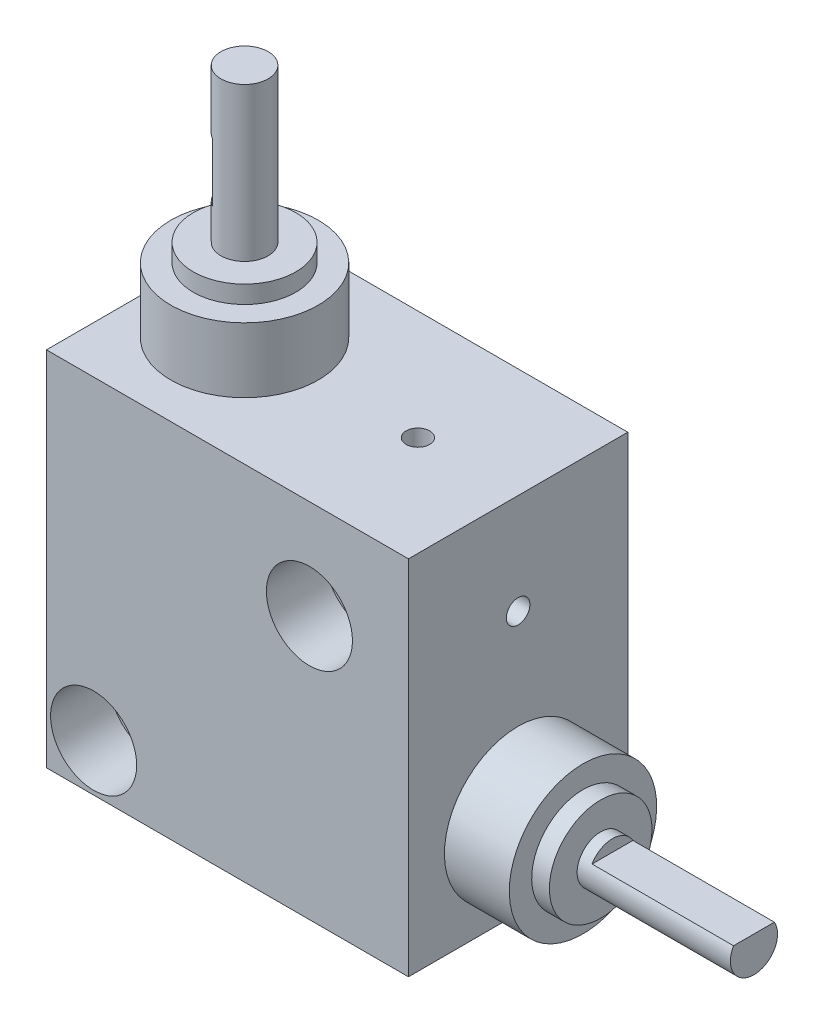
ISO-10303-21;
HEADER;
FILE_DESCRIPTION(('STEP AP214'),'2;1');
FILE_NAME('part.step','',(''),(''),'','','');
FILE_SCHEMA(('AUTOMOTIVE_DESIGN { 1 0 10303 214 1 1 1 1 }'));
ENDSEC;
DATA;
#1=APPLICATION_CONTEXT('core data for automotive mechanical design processes');
#2=APPLICATION_PROTOCOL_DEFINITION('international standard','automotive_design',2000,#1);
#3=PRODUCT_CONTEXT('',#1,'mechanical');
#4=PRODUCT('Part','Part','',(#3));
#5=PRODUCT_RELATED_PRODUCT_CATEGORY('part','',(#4));
#6=PRODUCT_DEFINITION_FORMATION('','',#4);
#7=PRODUCT_DEFINITION_CONTEXT('part definition',#1,'design');
#8=PRODUCT_DEFINITION('design','',#6,#7);
#9=PRODUCT_DEFINITION_SHAPE('','',#8);
#10=(LENGTH_UNIT() NAMED_UNIT(*) SI_UNIT(.MILLI.,.METRE.));
#11=(NAMED_UNIT(*) PLANE_ANGLE_UNIT() SI_UNIT($,.RADIAN.));
#12=(NAMED_UNIT(*) SI_UNIT($,.STERADIAN.) SOLID_ANGLE_UNIT());
#13=UNCERTAINTY_MEASURE_WITH_UNIT(LENGTH_MEASURE(1.E-05),#10,'distance_accuracy_value','');
#14=(GEOMETRIC_REPRESENTATION_CONTEXT(3) GLOBAL_UNCERTAINTY_ASSIGNED_CONTEXT((#13)) GLOBAL_UNIT_ASSIGNED_CONTEXT((#10,
#11,#12)) REPRESENTATION_CONTEXT('',''));
#15=CARTESIAN_POINT('',(0.,0.,0.));
#16=DIRECTION('',(0.,0.,1.));
#17=DIRECTION('',(1.,0.,0.));
#18=AXIS2_PLACEMENT_3D('',#15,#16,#17);
#19=CARTESIAN_POINT('',(7.5,50.7,0.));
#20=DIRECTION('',(0.,1.,0.));
#21=DIRECTION('',(-1.,0.,0.));
#22=AXIS2_PLACEMENT_3D('',#19,#20,#21);
#23=CYLINDRICAL_SURFACE('',#22,2.);
#24=CARTESIAN_POINT('',(7.5,50.7,0.));
#25=DIRECTION('',(0.,1.,0.));
#26=DIRECTION('',(-1.,0.,0.));
#27=AXIS2_PLACEMENT_3D('',#24,#25,#26);
#28=CIRCLE('',#27,2.);
#29=CARTESIAN_POINT('',(5.5,50.7,0.));
#30=VERTEX_POINT('',#29);
#31=EDGE_CURVE('E83',#30,#30,#28,.T.);
#32=ORIENTED_EDGE('',*,*,#31,.F.);
#33=EDGE_LOOP('',(#32));
#34=FACE_BOUND('',#33,.T.);
#35=CARTESIAN_POINT('',(7.5,37.7,0.));
#36=DIRECTION('',(0.,1.,0.));
#37=DIRECTION('',(-1.,0.,0.));
#38=AXIS2_PLACEMENT_3D('',#35,#36,#37);
#39=CIRCLE('',#38,2.);
#40=CARTESIAN_POINT('',(5.5,37.7,0.));
#41=VERTEX_POINT('',#40);
#42=EDGE_CURVE('E88',#41,#41,#39,.T.);
#43=ORIENTED_EDGE('',*,*,#42,.T.);
#44=EDGE_LOOP('',(#43));
#45=FACE_BOUND('',#44,.T.);
#46=DIRECTION('',(0.,1.,0.));
#47=VECTOR('',#46,1.);
#48=CARTESIAN_POINT('',(6.5,50.7,1.73205080756888));
#49=LINE('',#48,#47);
#50=CARTESIAN_POINT('',(6.5,40.7,1.73205080756888));
#51=VERTEX_POINT('',#50);
#52=CARTESIAN_POINT('',(6.5,45.7,1.73205080756888));
#53=VERTEX_POINT('',#52);
#54=EDGE_CURVE('E72',#51,#53,#49,.T.);
#55=ORIENTED_EDGE('',*,*,#54,.F.);
#56=CARTESIAN_POINT('',(7.5,40.7,0.));
#57=DIRECTION('',(0.,1.,0.));
#58=DIRECTION('',(0.,0.,1.));
#59=AXIS2_PLACEMENT_3D('',#56,#57,#58);
#60=CIRCLE('',#59,2.);
#61=CARTESIAN_POINT('',(6.5,40.7,-1.73205080756888));
#62=VERTEX_POINT('',#61);
#63=EDGE_CURVE('E12',#51,#62,#60,.F.);
#64=ORIENTED_EDGE('',*,*,#63,.T.);
#65=DIRECTION('',(0.,1.,0.));
#66=VECTOR('',#65,1.);
#67=CARTESIAN_POINT('',(6.5,50.7,-1.73205080756888));
#68=LINE('',#67,#66);
#69=CARTESIAN_POINT('',(6.5,45.7,-1.73205080756888));
#70=VERTEX_POINT('',#69);
#71=EDGE_CURVE('E52',#70,#62,#68,.F.);
#72=ORIENTED_EDGE('',*,*,#71,.F.);
#73=CARTESIAN_POINT('',(7.5,45.7,0.));
#74=DIRECTION('',(0.,1.,0.));
#75=DIRECTION('',(0.,0.,1.));
#76=AXIS2_PLACEMENT_3D('',#73,#74,#75);
#77=CIRCLE('',#76,2.);
#78=EDGE_CURVE('E70',#53,#70,#77,.F.);
#79=ORIENTED_EDGE('',*,*,#78,.F.);
#80=EDGE_LOOP('',(#55,#64,#72,#79));
#81=FACE_BOUND('',#80,.T.);
#82=ADVANCED_FACE('F44',(#34,#45,#81),#23,.T.);
#83=CARTESIAN_POINT('',(7.5,30.7,0.));
#84=DIRECTION('',(0.,-1.,0.));
#85=DIRECTION('',(1.,0.,0.));
#86=AXIS2_PLACEMENT_3D('',#83,#84,#85);
#87=PLANE('',#86);
#88=CARTESIAN_POINT('',(7.5,30.7,0.));
#89=DIRECTION('',(0.,1.,0.));
#90=DIRECTION('',(-1.,0.,0.));
#91=AXIS2_PLACEMENT_3D('',#88,#89,#90);
#92=CIRCLE('',#91,6.25);
#93=CARTESIAN_POINT('',(1.25,30.7,0.));
#94=VERTEX_POINT('',#93);
#95=EDGE_CURVE('E75',#94,#94,#92,.T.);
#96=ORIENTED_EDGE('',*,*,#95,.F.);
#97=EDGE_LOOP('',(#96));
#98=FACE_BOUND('',#97,.T.);
#99=ADVANCED_FACE('F46',(#98),#87,.T.);
#100=CARTESIAN_POINT('',(7.5,50.7,0.));
#101=DIRECTION('',(0.,1.,0.));
#102=DIRECTION('',(-1.,0.,0.));
#103=AXIS2_PLACEMENT_3D('',#100,#101,#102);
#104=CYLINDRICAL_SURFACE('',#103,6.25);
#105=ORIENTED_EDGE('',*,*,#95,.T.);
#106=EDGE_LOOP('',(#105));
#107=FACE_BOUND('',#106,.T.);
#108=CARTESIAN_POINT('',(7.5,36.2,0.));
#109=DIRECTION('',(0.,1.,0.));
#110=DIRECTION('',(-1.,0.,0.));
#111=AXIS2_PLACEMENT_3D('',#108,#109,#110);
#112=CIRCLE('',#111,6.25);
#113=CARTESIAN_POINT('',(1.25,36.2,0.));
#114=VERTEX_POINT('',#113);
#115=EDGE_CURVE('E97',#114,#114,#112,.T.);
#116=ORIENTED_EDGE('',*,*,#115,.F.);
#117=EDGE_LOOP('',(#116));
#118=FACE_BOUND('',#117,.T.);
#119=ADVANCED_FACE('F103',(#107,#118),#104,.T.);
#120=CARTESIAN_POINT('',(1.25,36.2,0.));
#121=DIRECTION('',(0.,1.,0.));
#122=DIRECTION('',(-1.,0.,0.));
#123=AXIS2_PLACEMENT_3D('',#120,#121,#122);
#124=PLANE('',#123);
#125=ORIENTED_EDGE('',*,*,#115,.T.);
#126=EDGE_LOOP('',(#125));
#127=FACE_BOUND('',#126,.T.);
#128=CARTESIAN_POINT('',(7.5,36.2,0.));
#129=DIRECTION('',(0.,1.,0.));
#130=DIRECTION('',(-1.,0.,0.));
#131=AXIS2_PLACEMENT_3D('',#128,#129,#130);
#132=CIRCLE('',#131,4.35);
#133=CARTESIAN_POINT('',(3.15,36.2,0.));
#134=VERTEX_POINT('',#133);
#135=EDGE_CURVE('E94',#134,#134,#132,.T.);
#136=ORIENTED_EDGE('',*,*,#135,.F.);
#137=EDGE_LOOP('',(#136));
#138=FACE_BOUND('',#137,.T.);
#139=ADVANCED_FACE('F111',(#127,#138),#124,.T.);
#140=CARTESIAN_POINT('',(7.5,50.7,0.));
#141=DIRECTION('',(0.,1.,0.));
#142=DIRECTION('',(-1.,0.,0.));
#143=AXIS2_PLACEMENT_3D('',#140,#141,#142);
#144=CYLINDRICAL_SURFACE('',#143,4.35);
#145=ORIENTED_EDGE('',*,*,#135,.T.);
#146=EDGE_LOOP('',(#145));
#147=FACE_BOUND('',#146,.T.);
#148=CARTESIAN_POINT('',(7.5,37.7,0.));
#149=DIRECTION('',(0.,1.,0.));
#150=DIRECTION('',(-1.,0.,0.));
#151=AXIS2_PLACEMENT_3D('',#148,#149,#150);
#152=CIRCLE('',#151,4.35);
#153=CARTESIAN_POINT('',(3.15,37.7,0.));
#154=VERTEX_POINT('',#153);
#155=EDGE_CURVE('E91',#154,#154,#152,.T.);
#156=ORIENTED_EDGE('',*,*,#155,.F.);
#157=EDGE_LOOP('',(#156));
#158=FACE_BOUND('',#157,.T.);
#159=ADVANCED_FACE('F125',(#147,#158),#144,.T.);
#160=CARTESIAN_POINT('',(3.15,37.7,0.));
#161=DIRECTION('',(0.,1.,0.));
#162=DIRECTION('',(-1.,0.,0.));
#163=AXIS2_PLACEMENT_3D('',#160,#161,#162);
#164=PLANE('',#163);
#165=ORIENTED_EDGE('',*,*,#155,.T.);
#166=EDGE_LOOP('',(#165));
#167=FACE_BOUND('',#166,.T.);
#168=ORIENTED_EDGE('',*,*,#42,.F.);
#169=EDGE_LOOP('',(#168));
#170=FACE_BOUND('',#169,.T.);
#171=ADVANCED_FACE('F122',(#167,#170),#164,.T.);
#172=CARTESIAN_POINT('',(5.5,50.7,0.));
#173=DIRECTION('',(0.,1.,0.));
#174=DIRECTION('',(-1.,0.,0.));
#175=AXIS2_PLACEMENT_3D('',#172,#173,#174);
#176=PLANE('',#175);
#177=ORIENTED_EDGE('',*,*,#31,.T.);
#178=EDGE_LOOP('',(#177));
#179=FACE_BOUND('',#178,.T.);
#180=ADVANCED_FACE('F120',(#179),#176,.T.);
#181=CARTESIAN_POINT('',(6.5,40.7,2.));
#182=DIRECTION('',(1.,0.,0.));
#183=DIRECTION('',(0.,0.,-1.));
#184=AXIS2_PLACEMENT_3D('',#181,#182,#183);
#185=PLANE('',#184);
#186=ORIENTED_EDGE('',*,*,#71,.T.);
#187=DIRECTION('',(0.,0.,-1.));
#188=VECTOR('',#187,1.);
#189=CARTESIAN_POINT('',(6.5,40.7,2.));
#190=LINE('',#189,#188);
#191=EDGE_CURVE('E79',#51,#62,#190,.T.);
#192=ORIENTED_EDGE('',*,*,#191,.F.);
#193=ORIENTED_EDGE('',*,*,#54,.T.);
#194=DIRECTION('',(0.,0.,-1.));
#195=VECTOR('',#194,1.);
#196=CARTESIAN_POINT('',(6.5,45.7,2.));
#197=LINE('',#196,#195);
#198=EDGE_CURVE('E78',#53,#70,#197,.T.);
#199=ORIENTED_EDGE('',*,*,#198,.T.);
#200=EDGE_LOOP('',(#186,#192,#193,#199));
#201=FACE_BOUND('',#200,.T.);
#202=ADVANCED_FACE('F77',(#201),#185,.F.);
#203=CARTESIAN_POINT('',(0.,40.7,0.));
#204=DIRECTION('',(0.,1.,0.));
#205=DIRECTION('',(0.,0.,1.));
#206=AXIS2_PLACEMENT_3D('',#203,#204,#205);
#207=PLANE('',#206);
#208=ORIENTED_EDGE('',*,*,#191,.T.);
#209=ORIENTED_EDGE('',*,*,#63,.F.);
#210=EDGE_LOOP('',(#208,#209));
#211=FACE_BOUND('',#210,.T.);
#212=ADVANCED_FACE('F163',(#211),#207,.T.);
#213=CARTESIAN_POINT('',(0.,45.7,0.));
#214=DIRECTION('',(0.,1.,0.));
#215=DIRECTION('',(0.,0.,1.));
#216=AXIS2_PLACEMENT_3D('',#213,#214,#215);
#217=PLANE('',#216);
#218=ORIENTED_EDGE('',*,*,#198,.F.);
#219=ORIENTED_EDGE('',*,*,#78,.T.);
#220=EDGE_LOOP('',(#218,#219));
#221=FACE_BOUND('',#220,.T.);
#222=ADVANCED_FACE('F81',(#221),#217,.F.);
#223=CLOSED_SHELL('',(#82,#99,#119,#139,#159,#171,#180,#202,#212,#222));
#224=MANIFOLD_SOLID_BREP('B2',#223);
#225=CARTESIAN_POINT('',(22.3,22.3,-9.3));
#226=DIRECTION('',(0.,0.,1.));
#227=DIRECTION('',(1.,0.,0.));
#228=AXIS2_PLACEMENT_3D('',#225,#226,#227);
#229=CYLINDRICAL_SURFACE('',#228,2.00000000000001);
#230=CARTESIAN_POINT('',(22.3,22.3,4.3));
#231=DIRECTION('',(0.,0.,1.));
#232=DIRECTION('',(1.,0.,0.));
#233=AXIS2_PLACEMENT_3D('',#230,#231,#232);
#234=CIRCLE('',#233,2.00000000000001);
#235=CARTESIAN_POINT('',(24.3,22.3,4.3));
#236=VERTEX_POINT('',#235);
#237=EDGE_CURVE('E312',#236,#236,#234,.F.);
#238=ORIENTED_EDGE('',*,*,#237,.F.);
#239=EDGE_LOOP('',(#238));
#240=FACE_BOUND('',#239,.T.);
#241=CARTESIAN_POINT('',(22.3,22.3,-4.3));
#242=DIRECTION('',(0.,0.,-1.));
#243=DIRECTION('',(-1.,0.,0.));
#244=AXIS2_PLACEMENT_3D('',#241,#242,#243);
#245=CIRCLE('',#244,2.00000000000001);
#246=CARTESIAN_POINT('',(20.3,22.3,-4.3));
#247=VERTEX_POINT('',#246);
#248=EDGE_CURVE('E299',#247,#247,#245,.F.);
#249=ORIENTED_EDGE('',*,*,#248,.F.);
#250=EDGE_LOOP('',(#249));
#251=FACE_BOUND('',#250,.T.);
#252=ADVANCED_FACE('F205',(#240,#251),#229,.F.);
#253=CARTESIAN_POINT('',(4.,4.,-9.3));
#254=DIRECTION('',(0.,0.,1.));
#255=DIRECTION('',(1.,0.,0.));
#256=AXIS2_PLACEMENT_3D('',#253,#254,#255);
#257=CYLINDRICAL_SURFACE('',#256,2.);
#258=CARTESIAN_POINT('',(4.,4.,4.3));
#259=DIRECTION('',(0.,0.,1.));
#260=DIRECTION('',(1.,0.,0.));
#261=AXIS2_PLACEMENT_3D('',#258,#259,#260);
#262=CIRCLE('',#261,2.);
#263=CARTESIAN_POINT('',(6.,4.,4.3));
#264=VERTEX_POINT('',#263);
#265=EDGE_CURVE('E319',#264,#264,#262,.F.);
#266=ORIENTED_EDGE('',*,*,#265,.F.);
#267=EDGE_LOOP('',(#266));
#268=FACE_BOUND('',#267,.T.);
#269=CARTESIAN_POINT('',(4.,4.,-4.3));
#270=DIRECTION('',(0.,0.,-1.));
#271=DIRECTION('',(-1.,0.,0.));
#272=AXIS2_PLACEMENT_3D('',#269,#270,#271);
#273=CIRCLE('',#272,2.);
#274=CARTESIAN_POINT('',(2.,4.,-4.3));
#275=VERTEX_POINT('',#274);
#276=EDGE_CURVE('E305',#275,#275,#273,.F.);
#277=ORIENTED_EDGE('',*,*,#276,.F.);
#278=EDGE_LOOP('',(#277));
#279=FACE_BOUND('',#278,.T.);
#280=ADVANCED_FACE('F368',(#268,#279),#257,.F.);
#281=CARTESIAN_POINT('',(0.,0.,9.3));
#282=DIRECTION('',(1.,0.,0.));
#283=DIRECTION('',(0.,0.,-1.));
#284=AXIS2_PLACEMENT_3D('',#281,#282,#283);
#285=PLANE('',#284);
#286=DIRECTION('',(0.,-1.,0.));
#287=VECTOR('',#286,1.);
#288=CARTESIAN_POINT('',(0.,0.,-9.3));
#289=LINE('',#288,#287);
#290=CARTESIAN_POINT('',(0.,30.7,-9.3));
#291=VERTEX_POINT('',#290);
#292=CARTESIAN_POINT('',(0.,0.,-9.3));
#293=VERTEX_POINT('',#292);
#294=EDGE_CURVE('E330',#291,#293,#289,.T.);
#295=ORIENTED_EDGE('',*,*,#294,.T.);
#296=DIRECTION('',(0.,0.,-1.));
#297=VECTOR('',#296,1.);
#298=CARTESIAN_POINT('',(0.,0.,9.3));
#299=LINE('',#298,#297);
#300=CARTESIAN_POINT('',(0.,0.,9.3));
#301=VERTEX_POINT('',#300);
#302=EDGE_CURVE('E344',#301,#293,#299,.T.);
#303=ORIENTED_EDGE('',*,*,#302,.F.);
#304=DIRECTION('',(0.,-1.,0.));
#305=VECTOR('',#304,1.);
#306=CARTESIAN_POINT('',(0.,0.,9.3));
#307=LINE('',#306,#305);
#308=CARTESIAN_POINT('',(0.,30.7,9.3));
#309=VERTEX_POINT('',#308);
#310=EDGE_CURVE('E323',#309,#301,#307,.T.);
#311=ORIENTED_EDGE('',*,*,#310,.F.);
#312=DIRECTION('',(0.,0.,-1.));
#313=VECTOR('',#312,1.);
#314=CARTESIAN_POINT('',(0.,30.7,9.3));
#315=LINE('',#314,#313);
#316=EDGE_CURVE('E329',#309,#291,#315,.T.);
#317=ORIENTED_EDGE('',*,*,#316,.T.);
#318=EDGE_LOOP('',(#295,#303,#311,#317));
#319=FACE_BOUND('',#318,.T.);
#320=ADVANCED_FACE('F207',(#319),#285,.F.);
#321=CARTESIAN_POINT('',(0.,0.,9.3));
#322=DIRECTION('',(0.,1.,0.));
#323=DIRECTION('',(0.,0.,1.));
#324=AXIS2_PLACEMENT_3D('',#321,#322,#323);
#325=PLANE('',#324);
#326=DIRECTION('',(1.,0.,0.));
#327=VECTOR('',#326,1.);
#328=CARTESIAN_POINT('',(0.,0.,-9.3));
#329=LINE('',#328,#327);
#330=CARTESIAN_POINT('',(30.7,0.,-9.3));
#331=VERTEX_POINT('',#330);
#332=EDGE_CURVE('E333',#293,#331,#329,.T.);
#333=ORIENTED_EDGE('',*,*,#332,.T.);
#334=DIRECTION('',(0.,0.,-1.));
#335=VECTOR('',#334,1.);
#336=CARTESIAN_POINT('',(30.7,0.,9.3));
#337=LINE('',#336,#335);
#338=CARTESIAN_POINT('',(30.7,0.,9.3));
#339=VERTEX_POINT('',#338);
#340=EDGE_CURVE('E341',#339,#331,#337,.T.);
#341=ORIENTED_EDGE('',*,*,#340,.F.);
#342=DIRECTION('',(1.,0.,0.));
#343=VECTOR('',#342,1.);
#344=CARTESIAN_POINT('',(0.,0.,9.3));
#345=LINE('',#344,#343);
#346=EDGE_CURVE('E256',#301,#339,#345,.T.);
#347=ORIENTED_EDGE('',*,*,#346,.F.);
#348=ORIENTED_EDGE('',*,*,#302,.T.);
#349=EDGE_LOOP('',(#333,#341,#347,#348));
#350=FACE_BOUND('',#349,.T.);
#351=ADVANCED_FACE('F397',(#350),#325,.F.);
#352=CARTESIAN_POINT('',(30.7,0.,9.3));
#353=DIRECTION('',(-1.,0.,0.));
#354=DIRECTION('',(0.,0.,1.));
#355=AXIS2_PLACEMENT_3D('',#352,#353,#354);
#356=PLANE('',#355);
#357=CARTESIAN_POINT('',(30.7,22.2,0.));
#358=DIRECTION('',(1.,0.,0.));
#359=DIRECTION('',(0.,0.,-1.));
#360=AXIS2_PLACEMENT_3D('',#357,#358,#359);
#361=CIRCLE('',#360,1.);
#362=CARTESIAN_POINT('',(30.7,22.2,-1.));
#363=VERTEX_POINT('',#362);
#364=EDGE_CURVE('E525',#363,#363,#361,.T.);
#365=ORIENTED_EDGE('',*,*,#364,.F.);
#366=EDGE_LOOP('',(#365));
#367=FACE_BOUND('',#366,.T.);
#368=CARTESIAN_POINT('',(30.7,7.5,0.));
#369=DIRECTION('',(1.,0.,0.));
#370=DIRECTION('',(0.,1.,0.));
#371=AXIS2_PLACEMENT_3D('',#368,#369,#370);
#372=CIRCLE('',#371,6.25);
#373=CARTESIAN_POINT('',(30.7,13.75,0.));
#374=VERTEX_POINT('',#373);
#375=EDGE_CURVE('E282',#374,#374,#372,.T.);
#376=ORIENTED_EDGE('',*,*,#375,.F.);
#377=EDGE_LOOP('',(#376));
#378=FACE_BOUND('',#377,.T.);
#379=DIRECTION('',(0.,1.,0.));
#380=VECTOR('',#379,1.);
#381=CARTESIAN_POINT('',(30.7,0.,-9.3));
#382=LINE('',#381,#380);
#383=CARTESIAN_POINT('',(30.7,30.7,-9.3));
#384=VERTEX_POINT('',#383);
#385=EDGE_CURVE('E335',#331,#384,#382,.T.);
#386=ORIENTED_EDGE('',*,*,#385,.T.);
#387=DIRECTION('',(0.,0.,-1.));
#388=VECTOR('',#387,1.);
#389=CARTESIAN_POINT('',(30.7,30.7,9.3));
#390=LINE('',#389,#388);
#391=CARTESIAN_POINT('',(30.7,30.7,9.3));
#392=VERTEX_POINT('',#391);
#393=EDGE_CURVE('E339',#392,#384,#390,.T.);
#394=ORIENTED_EDGE('',*,*,#393,.F.);
#395=DIRECTION('',(0.,1.,0.));
#396=VECTOR('',#395,1.);
#397=CARTESIAN_POINT('',(30.7,0.,9.3));
#398=LINE('',#397,#396);
#399=EDGE_CURVE('E326',#339,#392,#398,.T.);
#400=ORIENTED_EDGE('',*,*,#399,.F.);
#401=ORIENTED_EDGE('',*,*,#340,.T.);
#402=EDGE_LOOP('',(#386,#394,#400,#401));
#403=FACE_BOUND('',#402,.T.);
#404=ADVANCED_FACE('F394',(#367,#378,#403),#356,.F.);
#405=CARTESIAN_POINT('',(0.,30.7,9.3));
#406=DIRECTION('',(0.,-1.,0.));
#407=DIRECTION('',(0.,0.,-1.));
#408=AXIS2_PLACEMENT_3D('',#405,#406,#407);
#409=PLANE('',#408);
#410=CARTESIAN_POINT('',(22.2,30.7,0.));
#411=DIRECTION('',(0.,1.,0.));
#412=DIRECTION('',(0.,0.,1.));
#413=AXIS2_PLACEMENT_3D('',#410,#411,#412);
#414=CIRCLE('',#413,1.);
#415=CARTESIAN_POINT('',(22.2,30.7,1.));
#416=VERTEX_POINT('',#415);
#417=EDGE_CURVE('E526',#416,#416,#414,.T.);
#418=ORIENTED_EDGE('',*,*,#417,.F.);
#419=EDGE_LOOP('',(#418));
#420=FACE_BOUND('',#419,.T.);
#421=DIRECTION('',(-1.,0.,0.));
#422=VECTOR('',#421,1.);
#423=CARTESIAN_POINT('',(0.,30.7,-9.3));
#424=LINE('',#423,#422);
#425=EDGE_CURVE('E248',#384,#291,#424,.T.);
#426=ORIENTED_EDGE('',*,*,#425,.T.);
#427=ORIENTED_EDGE('',*,*,#316,.F.);
#428=DIRECTION('',(-1.,0.,0.));
#429=VECTOR('',#428,1.);
#430=CARTESIAN_POINT('',(0.,30.7,9.3));
#431=LINE('',#430,#429);
#432=EDGE_CURVE('E227',#392,#309,#431,.T.);
#433=ORIENTED_EDGE('',*,*,#432,.F.);
#434=ORIENTED_EDGE('',*,*,#393,.T.);
#435=EDGE_LOOP('',(#426,#427,#433,#434));
#436=FACE_BOUND('',#435,.T.);
#437=ADVANCED_FACE('F386',(#420,#436),#409,.F.);
#438=CARTESIAN_POINT('',(0.,0.,9.3));
#439=DIRECTION('',(0.,0.,-1.));
#440=DIRECTION('',(-1.,0.,0.));
#441=AXIS2_PLACEMENT_3D('',#438,#439,#440);
#442=PLANE('',#441);
#443=CARTESIAN_POINT('',(22.3,22.3,9.3));
#444=DIRECTION('',(0.,0.,1.));
#445=DIRECTION('',(1.,0.,0.));
#446=AXIS2_PLACEMENT_3D('',#443,#444,#445);
#447=CIRCLE('',#446,3.65);
#448=CARTESIAN_POINT('',(25.95,22.3,9.3));
#449=VERTEX_POINT('',#448);
#450=EDGE_CURVE('E313',#449,#449,#447,.T.);
#451=ORIENTED_EDGE('',*,*,#450,.F.);
#452=EDGE_LOOP('',(#451));
#453=FACE_BOUND('',#452,.T.);
#454=CARTESIAN_POINT('',(4.,4.,9.3));
#455=DIRECTION('',(0.,0.,1.));
#456=DIRECTION('',(1.,0.,0.));
#457=AXIS2_PLACEMENT_3D('',#454,#455,#456);
#458=CIRCLE('',#457,3.65);
#459=CARTESIAN_POINT('',(7.65,4.,9.3));
#460=VERTEX_POINT('',#459);
#461=EDGE_CURVE('E320',#460,#460,#458,.T.);
#462=ORIENTED_EDGE('',*,*,#461,.F.);
#463=EDGE_LOOP('',(#462));
#464=FACE_BOUND('',#463,.T.);
#465=ORIENTED_EDGE('',*,*,#310,.T.);
#466=ORIENTED_EDGE('',*,*,#346,.T.);
#467=ORIENTED_EDGE('',*,*,#399,.T.);
#468=ORIENTED_EDGE('',*,*,#432,.T.);
#469=EDGE_LOOP('',(#465,#466,#467,#468));
#470=FACE_BOUND('',#469,.T.);
#471=ADVANCED_FACE('F382',(#453,#464,#470),#442,.F.);
#472=CARTESIAN_POINT('',(0.,0.,-9.3));
#473=DIRECTION('',(0.,0.,-1.));
#474=DIRECTION('',(-1.,0.,0.));
#475=AXIS2_PLACEMENT_3D('',#472,#473,#474);
#476=PLANE('',#475);
#477=CARTESIAN_POINT('',(22.3,22.3,-9.3));
#478=DIRECTION('',(0.,0.,-1.));
#479=DIRECTION('',(-1.,0.,0.));
#480=AXIS2_PLACEMENT_3D('',#477,#478,#479);
#481=CIRCLE('',#480,3.65);
#482=CARTESIAN_POINT('',(18.65,22.3,-9.3));
#483=VERTEX_POINT('',#482);
#484=EDGE_CURVE('E295',#483,#483,#481,.T.);
#485=ORIENTED_EDGE('',*,*,#484,.F.);
#486=EDGE_LOOP('',(#485));
#487=FACE_BOUND('',#486,.T.);
#488=CARTESIAN_POINT('',(4.,4.,-9.3));
#489=DIRECTION('',(0.,0.,-1.));
#490=DIRECTION('',(-1.,0.,0.));
#491=AXIS2_PLACEMENT_3D('',#488,#489,#490);
#492=CIRCLE('',#491,3.65);
#493=CARTESIAN_POINT('',(0.35,4.,-9.3));
#494=VERTEX_POINT('',#493);
#495=EDGE_CURVE('E306',#494,#494,#492,.T.);
#496=ORIENTED_EDGE('',*,*,#495,.F.);
#497=EDGE_LOOP('',(#496));
#498=FACE_BOUND('',#497,.T.);
#499=ORIENTED_EDGE('',*,*,#294,.F.);
#500=ORIENTED_EDGE('',*,*,#425,.F.);
#501=ORIENTED_EDGE('',*,*,#385,.F.);
#502=ORIENTED_EDGE('',*,*,#332,.F.);
#503=EDGE_LOOP('',(#499,#500,#501,#502));
#504=FACE_BOUND('',#503,.T.);
#505=ADVANCED_FACE('F385',(#487,#498,#504),#476,.T.);
#506=CARTESIAN_POINT('',(4.,4.,4.3));
#507=DIRECTION('',(0.,0.,1.));
#508=DIRECTION('',(1.,0.,0.));
#509=AXIS2_PLACEMENT_3D('',#506,#507,#508);
#510=PLANE('',#509);
#511=CARTESIAN_POINT('',(4.,4.,4.3));
#512=DIRECTION('',(0.,0.,1.));
#513=DIRECTION('',(1.,0.,0.));
#514=AXIS2_PLACEMENT_3D('',#511,#512,#513);
#515=CIRCLE('',#514,3.65);
#516=CARTESIAN_POINT('',(7.65,4.,4.3));
#517=VERTEX_POINT('',#516);
#518=EDGE_CURVE('E316',#517,#517,#515,.T.);
#519=ORIENTED_EDGE('',*,*,#518,.T.);
#520=EDGE_LOOP('',(#519));
#521=FACE_BOUND('',#520,.T.);
#522=ORIENTED_EDGE('',*,*,#265,.T.);
#523=EDGE_LOOP('',(#522));
#524=FACE_BOUND('',#523,.T.);
#525=ADVANCED_FACE('F390',(#521,#524),#510,.T.);
#526=CARTESIAN_POINT('',(4.,4.,4.3));
#527=DIRECTION('',(0.,0.,1.));
#528=DIRECTION('',(1.,0.,0.));
#529=AXIS2_PLACEMENT_3D('',#526,#527,#528);
#530=CYLINDRICAL_SURFACE('',#529,3.65);
#531=ORIENTED_EDGE('',*,*,#518,.F.);
#532=EDGE_LOOP('',(#531));
#533=FACE_BOUND('',#532,.T.);
#534=ORIENTED_EDGE('',*,*,#461,.T.);
#535=EDGE_LOOP('',(#534));
#536=FACE_BOUND('',#535,.T.);
#537=ADVANCED_FACE('F379',(#533,#536),#530,.F.);
#538=CARTESIAN_POINT('',(22.3,22.3,4.3));
#539=DIRECTION('',(0.,0.,1.));
#540=DIRECTION('',(1.,0.,0.));
#541=AXIS2_PLACEMENT_3D('',#538,#539,#540);
#542=PLANE('',#541);
#543=CARTESIAN_POINT('',(22.3,22.3,4.3));
#544=DIRECTION('',(0.,0.,1.));
#545=DIRECTION('',(1.,0.,0.));
#546=AXIS2_PLACEMENT_3D('',#543,#544,#545);
#547=CIRCLE('',#546,3.65);
#548=CARTESIAN_POINT('',(25.95,22.3,4.3));
#549=VERTEX_POINT('',#548);
#550=EDGE_CURVE('E309',#549,#549,#547,.T.);
#551=ORIENTED_EDGE('',*,*,#550,.T.);
#552=EDGE_LOOP('',(#551));
#553=FACE_BOUND('',#552,.T.);
#554=ORIENTED_EDGE('',*,*,#237,.T.);
#555=EDGE_LOOP('',(#554));
#556=FACE_BOUND('',#555,.T.);
#557=ADVANCED_FACE('F434',(#553,#556),#542,.T.);
#558=CARTESIAN_POINT('',(22.3,22.3,4.3));
#559=DIRECTION('',(0.,0.,1.));
#560=DIRECTION('',(1.,0.,0.));
#561=AXIS2_PLACEMENT_3D('',#558,#559,#560);
#562=CYLINDRICAL_SURFACE('',#561,3.65);
#563=ORIENTED_EDGE('',*,*,#550,.F.);
#564=EDGE_LOOP('',(#563));
#565=FACE_BOUND('',#564,.T.);
#566=ORIENTED_EDGE('',*,*,#450,.T.);
#567=EDGE_LOOP('',(#566));
#568=FACE_BOUND('',#567,.T.);
#569=ADVANCED_FACE('F429',(#565,#568),#562,.F.);
#570=CARTESIAN_POINT('',(4.,4.,-4.3));
#571=DIRECTION('',(0.,0.,-1.));
#572=DIRECTION('',(-1.,0.,0.));
#573=AXIS2_PLACEMENT_3D('',#570,#571,#572);
#574=PLANE('',#573);
#575=CARTESIAN_POINT('',(4.,4.,-4.3));
#576=DIRECTION('',(0.,0.,-1.));
#577=DIRECTION('',(-1.,0.,0.));
#578=AXIS2_PLACEMENT_3D('',#575,#576,#577);
#579=CIRCLE('',#578,3.65);
#580=CARTESIAN_POINT('',(0.35,4.,-4.3));
#581=VERTEX_POINT('',#580);
#582=EDGE_CURVE('E302',#581,#581,#579,.T.);
#583=ORIENTED_EDGE('',*,*,#582,.T.);
#584=EDGE_LOOP('',(#583));
#585=FACE_BOUND('',#584,.T.);
#586=ORIENTED_EDGE('',*,*,#276,.T.);
#587=EDGE_LOOP('',(#586));
#588=FACE_BOUND('',#587,.T.);
#589=ADVANCED_FACE('F433',(#585,#588),#574,.T.);
#590=CARTESIAN_POINT('',(4.,4.,-4.3));
#591=DIRECTION('',(0.,0.,-1.));
#592=DIRECTION('',(-1.,0.,0.));
#593=AXIS2_PLACEMENT_3D('',#590,#591,#592);
#594=CYLINDRICAL_SURFACE('',#593,3.65);
#595=ORIENTED_EDGE('',*,*,#582,.F.);
#596=EDGE_LOOP('',(#595));
#597=FACE_BOUND('',#596,.T.);
#598=ORIENTED_EDGE('',*,*,#495,.T.);
#599=EDGE_LOOP('',(#598));
#600=FACE_BOUND('',#599,.T.);
#601=ADVANCED_FACE('F568',(#597,#600),#594,.F.);
#602=CARTESIAN_POINT('',(22.3,22.3,-4.3));
#603=DIRECTION('',(0.,0.,-1.));
#604=DIRECTION('',(-1.,0.,0.));
#605=AXIS2_PLACEMENT_3D('',#602,#603,#604);
#606=PLANE('',#605);
#607=CARTESIAN_POINT('',(22.3,22.3,-4.3));
#608=DIRECTION('',(0.,0.,-1.));
#609=DIRECTION('',(-1.,0.,0.));
#610=AXIS2_PLACEMENT_3D('',#607,#608,#609);
#611=CIRCLE('',#610,3.65);
#612=CARTESIAN_POINT('',(18.65,22.3,-4.3));
#613=VERTEX_POINT('',#612);
#614=EDGE_CURVE('E296',#613,#613,#611,.T.);
#615=ORIENTED_EDGE('',*,*,#614,.T.);
#616=EDGE_LOOP('',(#615));
#617=FACE_BOUND('',#616,.T.);
#618=ORIENTED_EDGE('',*,*,#248,.T.);
#619=EDGE_LOOP('',(#618));
#620=FACE_BOUND('',#619,.T.);
#621=ADVANCED_FACE('F565',(#617,#620),#606,.T.);
#622=CARTESIAN_POINT('',(22.3,22.3,-4.3));
#623=DIRECTION('',(0.,0.,-1.));
#624=DIRECTION('',(-1.,0.,0.));
#625=AXIS2_PLACEMENT_3D('',#622,#623,#624);
#626=CYLINDRICAL_SURFACE('',#625,3.65);
#627=ORIENTED_EDGE('',*,*,#614,.F.);
#628=EDGE_LOOP('',(#627));
#629=FACE_BOUND('',#628,.T.);
#630=ORIENTED_EDGE('',*,*,#484,.T.);
#631=EDGE_LOOP('',(#630));
#632=FACE_BOUND('',#631,.T.);
#633=ADVANCED_FACE('F563',(#629,#632),#626,.F.);
#634=CARTESIAN_POINT('',(36.2,13.75,0.));
#635=DIRECTION('',(1.,0.,0.));
#636=DIRECTION('',(0.,1.,0.));
#637=AXIS2_PLACEMENT_3D('',#634,#635,#636);
#638=PLANE('',#637);
#639=CARTESIAN_POINT('',(36.2,7.5,0.));
#640=DIRECTION('',(1.,0.,0.));
#641=DIRECTION('',(0.,1.,0.));
#642=AXIS2_PLACEMENT_3D('',#639,#640,#641);
#643=CIRCLE('',#642,6.25);
#644=CARTESIAN_POINT('',(36.2,13.75,0.));
#645=VERTEX_POINT('',#644);
#646=EDGE_CURVE('E286',#645,#645,#643,.T.);
#647=ORIENTED_EDGE('',*,*,#646,.T.);
#648=EDGE_LOOP('',(#647));
#649=FACE_BOUND('',#648,.T.);
#650=CARTESIAN_POINT('',(36.2,7.5,0.));
#651=DIRECTION('',(1.,0.,0.));
#652=DIRECTION('',(0.,1.,0.));
#653=AXIS2_PLACEMENT_3D('',#650,#651,#652);
#654=CIRCLE('',#653,4.35);
#655=CARTESIAN_POINT('',(36.2,11.85,0.));
#656=VERTEX_POINT('',#655);
#657=EDGE_CURVE('E535',#656,#656,#654,.T.);
#658=ORIENTED_EDGE('',*,*,#657,.F.);
#659=EDGE_LOOP('',(#658));
#660=FACE_BOUND('',#659,.T.);
#661=ADVANCED_FACE('F559',(#649,#660),#638,.T.);
#662=CARTESIAN_POINT('',(50.7,7.5,0.));
#663=DIRECTION('',(1.,0.,0.));
#664=DIRECTION('',(0.,1.,0.));
#665=AXIS2_PLACEMENT_3D('',#662,#663,#664);
#666=CYLINDRICAL_SURFACE('',#665,6.25);
#667=ORIENTED_EDGE('',*,*,#375,.T.);
#668=EDGE_LOOP('',(#667));
#669=FACE_BOUND('',#668,.T.);
#670=ORIENTED_EDGE('',*,*,#646,.F.);
#671=EDGE_LOOP('',(#670));
#672=FACE_BOUND('',#671,.T.);
#673=ADVANCED_FACE('F556',(#669,#672),#666,.T.);
#674=CARTESIAN_POINT('',(50.7,9.5,0.));
#675=DIRECTION('',(1.,0.,0.));
#676=DIRECTION('',(0.,1.,0.));
#677=AXIS2_PLACEMENT_3D('',#674,#675,#676);
#678=PLANE('',#677);
#679=DIRECTION('',(0.,0.,-1.));
#680=VECTOR('',#679,1.);
#681=CARTESIAN_POINT('',(50.7,8.5,2.));
#682=LINE('',#681,#680);
#683=CARTESIAN_POINT('',(50.7,8.5,1.73205080756888));
#684=VERTEX_POINT('',#683);
#685=CARTESIAN_POINT('',(50.7,8.5,-1.73205080756888));
#686=VERTEX_POINT('',#685);
#687=EDGE_CURVE('E268',#684,#686,#682,.T.);
#688=ORIENTED_EDGE('',*,*,#687,.F.);
#689=CARTESIAN_POINT('',(50.7,7.5,0.));
#690=DIRECTION('',(1.,0.,0.));
#691=DIRECTION('',(0.,1.,0.));
#692=AXIS2_PLACEMENT_3D('',#689,#690,#691);
#693=CIRCLE('',#692,2.);
#694=EDGE_CURVE('E277',#684,#686,#693,.T.);
#695=ORIENTED_EDGE('',*,*,#694,.T.);
#696=EDGE_LOOP('',(#688,#695));
#697=FACE_BOUND('',#696,.T.);
#698=ADVANCED_FACE('F276',(#697),#678,.T.);
#699=CARTESIAN_POINT('',(50.7,7.5,0.));
#700=DIRECTION('',(1.,0.,0.));
#701=DIRECTION('',(0.,1.,0.));
#702=AXIS2_PLACEMENT_3D('',#699,#700,#701);
#703=CYLINDRICAL_SURFACE('',#702,2.);
#704=DIRECTION('',(1.,0.,0.));
#705=VECTOR('',#704,1.);
#706=CARTESIAN_POINT('',(50.7,8.5,-1.73205080756888));
#707=LINE('',#706,#705);
#708=CARTESIAN_POINT('',(38.7,8.5,-1.73205080756888));
#709=VERTEX_POINT('',#708);
#710=EDGE_CURVE('E42',#686,#709,#707,.F.);
#711=ORIENTED_EDGE('',*,*,#710,.F.);
#712=ORIENTED_EDGE('',*,*,#694,.F.);
#713=DIRECTION('',(1.,0.,0.));
#714=VECTOR('',#713,1.);
#715=CARTESIAN_POINT('',(50.7,8.5,1.73205080756888));
#716=LINE('',#715,#714);
#717=CARTESIAN_POINT('',(38.7,8.5,1.73205080756888));
#718=VERTEX_POINT('',#717);
#719=EDGE_CURVE('E213',#718,#684,#716,.T.);
#720=ORIENTED_EDGE('',*,*,#719,.F.);
#721=CARTESIAN_POINT('',(38.7,7.5,0.));
#722=DIRECTION('',(1.,0.,0.));
#723=DIRECTION('',(0.,0.,-1.));
#724=AXIS2_PLACEMENT_3D('',#721,#722,#723);
#725=CIRCLE('',#724,2.);
#726=EDGE_CURVE('E273',#718,#709,#725,.F.);
#727=ORIENTED_EDGE('',*,*,#726,.T.);
#728=EDGE_LOOP('',(#711,#712,#720,#727));
#729=FACE_BOUND('',#728,.T.);
#730=CARTESIAN_POINT('',(37.7,7.5,0.));
#731=DIRECTION('',(1.,0.,0.));
#732=DIRECTION('',(0.,1.,0.));
#733=AXIS2_PLACEMENT_3D('',#730,#731,#732);
#734=CIRCLE('',#733,2.);
#735=CARTESIAN_POINT('',(37.7,9.5,0.));
#736=VERTEX_POINT('',#735);
#737=EDGE_CURVE('E283',#736,#736,#734,.T.);
#738=ORIENTED_EDGE('',*,*,#737,.T.);
#739=EDGE_LOOP('',(#738));
#740=FACE_BOUND('',#739,.T.);
#741=ADVANCED_FACE('F280',(#729,#740),#703,.T.);
#742=CARTESIAN_POINT('',(37.7,11.85,0.));
#743=DIRECTION('',(1.,0.,0.));
#744=DIRECTION('',(0.,1.,0.));
#745=AXIS2_PLACEMENT_3D('',#742,#743,#744);
#746=PLANE('',#745);
#747=CARTESIAN_POINT('',(37.7,7.5,0.));
#748=DIRECTION('',(1.,0.,0.));
#749=DIRECTION('',(0.,1.,0.));
#750=AXIS2_PLACEMENT_3D('',#747,#748,#749);
#751=CIRCLE('',#750,4.35);
#752=CARTESIAN_POINT('',(37.7,11.85,0.));
#753=VERTEX_POINT('',#752);
#754=EDGE_CURVE('E289',#753,#753,#751,.T.);
#755=ORIENTED_EDGE('',*,*,#754,.T.);
#756=EDGE_LOOP('',(#755));
#757=FACE_BOUND('',#756,.T.);
#758=ORIENTED_EDGE('',*,*,#737,.F.);
#759=EDGE_LOOP('',(#758));
#760=FACE_BOUND('',#759,.T.);
#761=ADVANCED_FACE('F541',(#757,#760),#746,.T.);
#762=CARTESIAN_POINT('',(50.7,7.5,0.));
#763=DIRECTION('',(1.,0.,0.));
#764=DIRECTION('',(0.,1.,0.));
#765=AXIS2_PLACEMENT_3D('',#762,#763,#764);
#766=CYLINDRICAL_SURFACE('',#765,4.35);
#767=ORIENTED_EDGE('',*,*,#657,.T.);
#768=EDGE_LOOP('',(#767));
#769=FACE_BOUND('',#768,.T.);
#770=ORIENTED_EDGE('',*,*,#754,.F.);
#771=EDGE_LOOP('',(#770));
#772=FACE_BOUND('',#771,.T.);
#773=ADVANCED_FACE('F365',(#769,#772),#766,.T.);
#774=CARTESIAN_POINT('',(38.7,8.5,2.));
#775=DIRECTION('',(0.,-1.,0.));
#776=DIRECTION('',(1.,0.,0.));
#777=AXIS2_PLACEMENT_3D('',#774,#775,#776);
#778=PLANE('',#777);
#779=ORIENTED_EDGE('',*,*,#710,.T.);
#780=DIRECTION('',(0.,0.,-1.));
#781=VECTOR('',#780,1.);
#782=CARTESIAN_POINT('',(38.7,8.5,2.));
#783=LINE('',#782,#781);
#784=EDGE_CURVE('E219',#718,#709,#783,.T.);
#785=ORIENTED_EDGE('',*,*,#784,.F.);
#786=ORIENTED_EDGE('',*,*,#719,.T.);
#787=ORIENTED_EDGE('',*,*,#687,.T.);
#788=EDGE_LOOP('',(#779,#785,#786,#787));
#789=FACE_BOUND('',#788,.T.);
#790=ADVANCED_FACE('F267',(#789),#778,.F.);
#791=CARTESIAN_POINT('',(38.7,0.,0.));
#792=DIRECTION('',(1.,0.,0.));
#793=DIRECTION('',(0.,0.,-1.));
#794=AXIS2_PLACEMENT_3D('',#791,#792,#793);
#795=PLANE('',#794);
#796=ORIENTED_EDGE('',*,*,#784,.T.);
#797=ORIENTED_EDGE('',*,*,#726,.F.);
#798=EDGE_LOOP('',(#796,#797));
#799=FACE_BOUND('',#798,.T.);
#800=ADVANCED_FACE('F354',(#799),#795,.T.);
#801=CARTESIAN_POINT('',(25.7,22.2,0.));
#802=DIRECTION('',(1.,0.,0.));
#803=DIRECTION('',(0.,0.,-1.));
#804=AXIS2_PLACEMENT_3D('',#801,#802,#803);
#805=CYLINDRICAL_SURFACE('',#804,1.);
#806=CARTESIAN_POINT('',(25.7,22.2,0.));
#807=DIRECTION('',(1.,0.,0.));
#808=DIRECTION('',(0.,0.,-1.));
#809=AXIS2_PLACEMENT_3D('',#806,#807,#808);
#810=CIRCLE('',#809,1.);
#811=CARTESIAN_POINT('',(25.7,22.2,-1.));
#812=VERTEX_POINT('',#811);
#813=EDGE_CURVE('E278',#812,#812,#810,.T.);
#814=ORIENTED_EDGE('',*,*,#813,.F.);
#815=EDGE_LOOP('',(#814));
#816=FACE_BOUND('',#815,.T.);
#817=ORIENTED_EDGE('',*,*,#364,.T.);
#818=EDGE_LOOP('',(#817));
#819=FACE_BOUND('',#818,.T.);
#820=ADVANCED_FACE('F356',(#816,#819),#805,.F.);
#821=CARTESIAN_POINT('',(25.7,22.2,0.));
#822=DIRECTION('',(1.,0.,0.));
#823=DIRECTION('',(0.,0.,-1.));
#824=AXIS2_PLACEMENT_3D('',#821,#822,#823);
#825=PLANE('',#824);
#826=ORIENTED_EDGE('',*,*,#813,.T.);
#827=EDGE_LOOP('',(#826));
#828=FACE_BOUND('',#827,.T.);
#829=ADVANCED_FACE('F362',(#828),#825,.T.);
#830=CARTESIAN_POINT('',(22.2,25.7,0.));
#831=DIRECTION('',(0.,1.,0.));
#832=DIRECTION('',(0.,0.,1.));
#833=AXIS2_PLACEMENT_3D('',#830,#831,#832);
#834=CYLINDRICAL_SURFACE('',#833,1.);
#835=CARTESIAN_POINT('',(22.2,25.7,0.));
#836=DIRECTION('',(0.,1.,0.));
#837=DIRECTION('',(0.,0.,1.));
#838=AXIS2_PLACEMENT_3D('',#835,#836,#837);
#839=CIRCLE('',#838,1.);
#840=CARTESIAN_POINT('',(22.2,25.7,1.));
#841=VERTEX_POINT('',#840);
#842=EDGE_CURVE('E524',#841,#841,#839,.T.);
#843=ORIENTED_EDGE('',*,*,#842,.F.);
#844=EDGE_LOOP('',(#843));
#845=FACE_BOUND('',#844,.T.);
#846=ORIENTED_EDGE('',*,*,#417,.T.);
#847=EDGE_LOOP('',(#846));
#848=FACE_BOUND('',#847,.T.);
#849=ADVANCED_FACE('F498',(#845,#848),#834,.F.);
#850=CARTESIAN_POINT('',(22.2,25.7,0.));
#851=DIRECTION('',(0.,1.,0.));
#852=DIRECTION('',(0.,0.,1.));
#853=AXIS2_PLACEMENT_3D('',#850,#851,#852);
#854=PLANE('',#853);
#855=ORIENTED_EDGE('',*,*,#842,.T.);
#856=EDGE_LOOP('',(#855));
#857=FACE_BOUND('',#856,.T.);
#858=ADVANCED_FACE('F508',(#857),#854,.T.);
#859=CLOSED_SHELL('',(#252,#280,#320,#351,#404,#437,#471,#505,#525,#537,#557,#569,#589,#601,
#621,#633,#661,#673,#698,#741,#761,#773,#790,#800,#820,#829,#849,#858));
#860=MANIFOLD_SOLID_BREP('B6',#859);
#861=ADVANCED_BREP_SHAPE_REPRESENTATION('',(#18,#224,#860),#14);
#862=SHAPE_DEFINITION_REPRESENTATION(#9,#861);
ENDSEC;
END-ISO-10303-21;
